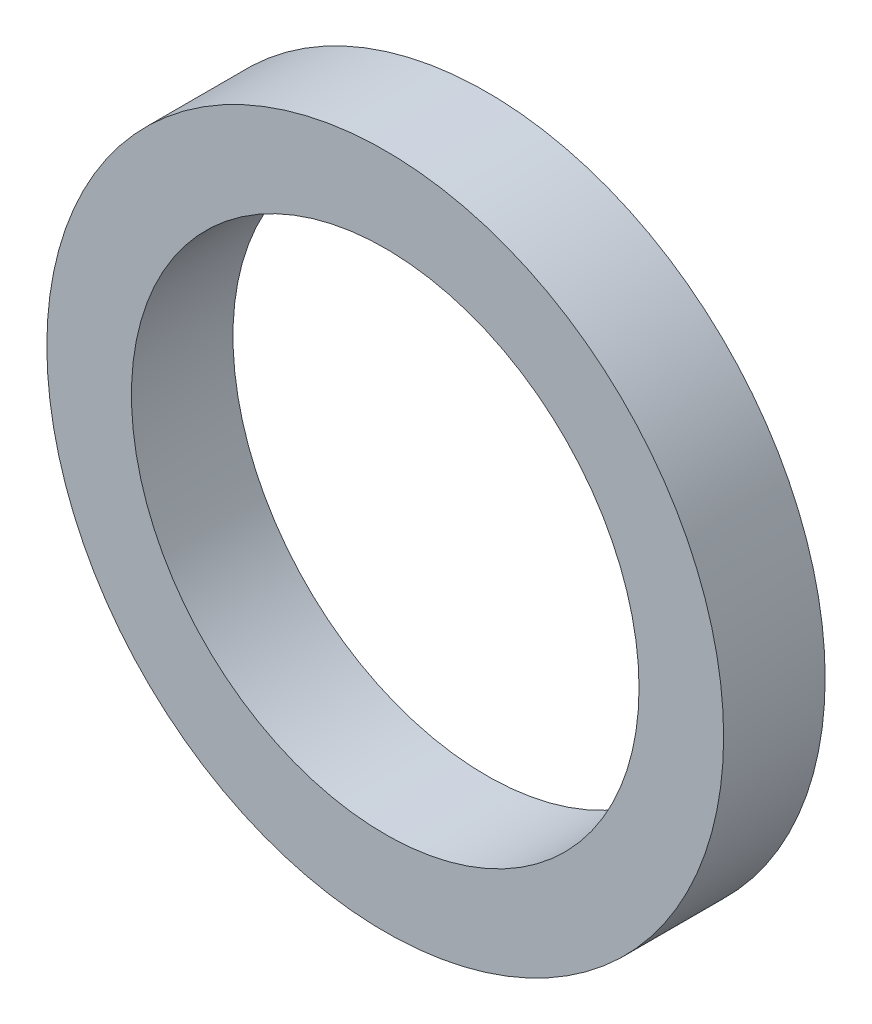
ISO-10303-21;
HEADER;
FILE_DESCRIPTION(('STEP AP214'),'2;1');
FILE_NAME('part.step','',(''),(''),'','','');
FILE_SCHEMA(('AUTOMOTIVE_DESIGN { 1 0 10303 214 1 1 1 1 }'));
ENDSEC;
DATA;
#1=APPLICATION_CONTEXT('core data for automotive mechanical design processes');
#2=APPLICATION_PROTOCOL_DEFINITION('international standard','automotive_design',2000,#1);
#3=PRODUCT_CONTEXT('',#1,'mechanical');
#4=PRODUCT('Part','Part','',(#3));
#5=PRODUCT_RELATED_PRODUCT_CATEGORY('part','',(#4));
#6=PRODUCT_DEFINITION_FORMATION('','',#4);
#7=PRODUCT_DEFINITION_CONTEXT('part definition',#1,'design');
#8=PRODUCT_DEFINITION('design','',#6,#7);
#9=PRODUCT_DEFINITION_SHAPE('','',#8);
#10=(LENGTH_UNIT() NAMED_UNIT(*) SI_UNIT(.MILLI.,.METRE.));
#11=(NAMED_UNIT(*) PLANE_ANGLE_UNIT() SI_UNIT($,.RADIAN.));
#12=(NAMED_UNIT(*) SI_UNIT($,.STERADIAN.) SOLID_ANGLE_UNIT());
#13=UNCERTAINTY_MEASURE_WITH_UNIT(LENGTH_MEASURE(1.E-05),#10,'distance_accuracy_value','');
#14=(GEOMETRIC_REPRESENTATION_CONTEXT(3) GLOBAL_UNCERTAINTY_ASSIGNED_CONTEXT((#13)) GLOBAL_UNIT_ASSIGNED_CONTEXT((#10,
#11,#12)) REPRESENTATION_CONTEXT('',''));
#15=CARTESIAN_POINT('',(0.,0.,0.));
#16=DIRECTION('',(0.,0.,1.));
#17=DIRECTION('',(1.,0.,0.));
#18=AXIS2_PLACEMENT_3D('',#15,#16,#17);
#19=CARTESIAN_POINT('',(0.,0.,1.905));
#20=DIRECTION('',(0.,0.,1.));
#21=DIRECTION('',(1.,0.,0.));
#22=AXIS2_PLACEMENT_3D('',#19,#20,#21);
#23=PLANE('',#22);
#24=CARTESIAN_POINT('',(0.,0.,1.905));
#25=DIRECTION('',(0.,0.,1.));
#26=DIRECTION('',(1.,0.,0.));
#27=AXIS2_PLACEMENT_3D('',#24,#25,#26);
#28=CIRCLE('',#27,6.35);
#29=CARTESIAN_POINT('',(6.35,0.,1.905));
#30=VERTEX_POINT('',#29);
#31=EDGE_CURVE('E10',#30,#30,#28,.T.);
#32=ORIENTED_EDGE('',*,*,#31,.T.);
#33=EDGE_LOOP('',(#32));
#34=FACE_BOUND('',#33,.T.);
#35=CARTESIAN_POINT('',(0.,0.,1.905));
#36=DIRECTION('',(0.,0.,1.));
#37=DIRECTION('',(1.,0.,0.));
#38=AXIS2_PLACEMENT_3D('',#35,#36,#37);
#39=CIRCLE('',#38,4.7625);
#40=CARTESIAN_POINT('',(4.7625,0.,1.905));
#41=VERTEX_POINT('',#40);
#42=EDGE_CURVE('E43',#41,#41,#39,.T.);
#43=ORIENTED_EDGE('',*,*,#42,.F.);
#44=EDGE_LOOP('',(#43));
#45=FACE_BOUND('',#44,.T.);
#46=ADVANCED_FACE('F32',(#34,#45),#23,.T.);
#47=CARTESIAN_POINT('',(0.,0.,0.));
#48=DIRECTION('',(0.,0.,1.));
#49=DIRECTION('',(1.,0.,0.));
#50=AXIS2_PLACEMENT_3D('',#47,#48,#49);
#51=PLANE('',#50);
#52=CARTESIAN_POINT('',(0.,0.,0.));
#53=DIRECTION('',(0.,0.,1.));
#54=DIRECTION('',(1.,0.,0.));
#55=AXIS2_PLACEMENT_3D('',#52,#53,#54);
#56=CIRCLE('',#55,6.35);
#57=CARTESIAN_POINT('',(6.35,0.,0.));
#58=VERTEX_POINT('',#57);
#59=EDGE_CURVE('E36',#58,#58,#56,.T.);
#60=ORIENTED_EDGE('',*,*,#59,.F.);
#61=EDGE_LOOP('',(#60));
#62=FACE_BOUND('',#61,.T.);
#63=CARTESIAN_POINT('',(0.,0.,0.));
#64=DIRECTION('',(0.,0.,1.));
#65=DIRECTION('',(1.,0.,0.));
#66=AXIS2_PLACEMENT_3D('',#63,#64,#65);
#67=CIRCLE('',#66,4.7625);
#68=CARTESIAN_POINT('',(4.7625,0.,0.));
#69=VERTEX_POINT('',#68);
#70=EDGE_CURVE('E45',#69,#69,#67,.T.);
#71=ORIENTED_EDGE('',*,*,#70,.T.);
#72=EDGE_LOOP('',(#71));
#73=FACE_BOUND('',#72,.T.);
#74=ADVANCED_FACE('F55',(#62,#73),#51,.F.);
#75=CARTESIAN_POINT('',(0.,0.,1.905));
#76=DIRECTION('',(0.,0.,-1.));
#77=DIRECTION('',(-1.,0.,0.));
#78=AXIS2_PLACEMENT_3D('',#75,#76,#77);
#79=CYLINDRICAL_SURFACE('',#78,6.35);
#80=ORIENTED_EDGE('',*,*,#31,.F.);
#81=EDGE_LOOP('',(#80));
#82=FACE_BOUND('',#81,.T.);
#83=ORIENTED_EDGE('',*,*,#59,.T.);
#84=EDGE_LOOP('',(#83));
#85=FACE_BOUND('',#84,.T.);
#86=ADVANCED_FACE('F34',(#82,#85),#79,.T.);
#87=CARTESIAN_POINT('',(0.,0.,1.905));
#88=DIRECTION('',(0.,0.,-1.));
#89=DIRECTION('',(-1.,0.,0.));
#90=AXIS2_PLACEMENT_3D('',#87,#88,#89);
#91=CYLINDRICAL_SURFACE('',#90,4.7625);
#92=ORIENTED_EDGE('',*,*,#42,.T.);
#93=EDGE_LOOP('',(#92));
#94=FACE_BOUND('',#93,.T.);
#95=ORIENTED_EDGE('',*,*,#70,.F.);
#96=EDGE_LOOP('',(#95));
#97=FACE_BOUND('',#96,.T.);
#98=ADVANCED_FACE('F51',(#94,#97),#91,.F.);
#99=CLOSED_SHELL('',(#46,#74,#86,#98));
#100=MANIFOLD_SOLID_BREP('B2',#99);
#101=ADVANCED_BREP_SHAPE_REPRESENTATION('',(#18,#100),#14);
#102=SHAPE_DEFINITION_REPRESENTATION(#9,#101);
ENDSEC;
END-ISO-10303-21;
